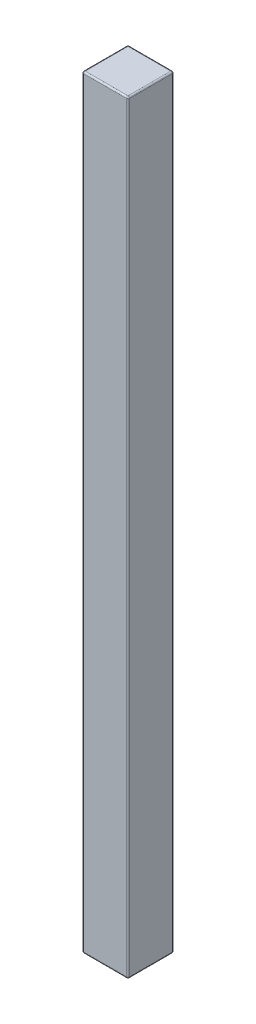
ISO-10303-21;
HEADER;
FILE_DESCRIPTION(('STEP AP214'),'2;1');
FILE_NAME('part.step','',(''),(''),'','','');
FILE_SCHEMA(('AUTOMOTIVE_DESIGN { 1 0 10303 214 1 1 1 1 }'));
ENDSEC;
DATA;
#1=APPLICATION_CONTEXT('core data for automotive mechanical design processes');
#2=APPLICATION_PROTOCOL_DEFINITION('international standard','automotive_design',2000,#1);
#3=PRODUCT_CONTEXT('',#1,'mechanical');
#4=PRODUCT('Part','Part','',(#3));
#5=PRODUCT_RELATED_PRODUCT_CATEGORY('part','',(#4));
#6=PRODUCT_DEFINITION_FORMATION('','',#4);
#7=PRODUCT_DEFINITION_CONTEXT('part definition',#1,'design');
#8=PRODUCT_DEFINITION('design','',#6,#7);
#9=PRODUCT_DEFINITION_SHAPE('','',#8);
#10=(LENGTH_UNIT() NAMED_UNIT(*) SI_UNIT(.MILLI.,.METRE.));
#11=(NAMED_UNIT(*) PLANE_ANGLE_UNIT() SI_UNIT($,.RADIAN.));
#12=(NAMED_UNIT(*) SI_UNIT($,.STERADIAN.) SOLID_ANGLE_UNIT());
#13=UNCERTAINTY_MEASURE_WITH_UNIT(LENGTH_MEASURE(1.E-05),#10,'distance_accuracy_value','');
#14=(GEOMETRIC_REPRESENTATION_CONTEXT(3) GLOBAL_UNCERTAINTY_ASSIGNED_CONTEXT((#13)) GLOBAL_UNIT_ASSIGNED_CONTEXT((#10,
#11,#12)) REPRESENTATION_CONTEXT('',''));
#15=CARTESIAN_POINT('',(0.,0.,0.));
#16=DIRECTION('',(0.,0.,1.));
#17=DIRECTION('',(1.,0.,0.));
#18=AXIS2_PLACEMENT_3D('',#15,#16,#17);
#19=CARTESIAN_POINT('',(1.5,50.,1.5));
#20=DIRECTION('',(-1.,0.,0.));
#21=DIRECTION('',(0.,0.,1.));
#22=AXIS2_PLACEMENT_3D('',#19,#20,#21);
#23=PLANE('',#22);
#24=DIRECTION('',(0.,-1.,0.));
#25=VECTOR('',#24,1.);
#26=CARTESIAN_POINT('',(1.5,50.,-1.4));
#27=LINE('',#26,#25);
#28=CARTESIAN_POINT('',(1.5,0.100000000000003,-1.4));
#29=VERTEX_POINT('',#28);
#30=CARTESIAN_POINT('',(1.5,49.9,-1.4));
#31=VERTEX_POINT('',#30);
#32=EDGE_CURVE('E132',#29,#31,#27,.F.);
#33=ORIENTED_EDGE('',*,*,#32,.T.);
#34=DIRECTION('',(0.,0.,-1.));
#35=VECTOR('',#34,1.);
#36=CARTESIAN_POINT('',(1.5,49.9,1.5));
#37=LINE('',#36,#35);
#38=CARTESIAN_POINT('',(1.5,49.9,1.4));
#39=VERTEX_POINT('',#38);
#40=EDGE_CURVE('E169',#31,#39,#37,.F.);
#41=ORIENTED_EDGE('',*,*,#40,.T.);
#42=DIRECTION('',(0.,-1.,0.));
#43=VECTOR('',#42,1.);
#44=CARTESIAN_POINT('',(1.5,50.,1.4));
#45=LINE('',#44,#43);
#46=CARTESIAN_POINT('',(1.5,0.100000000000003,1.4));
#47=VERTEX_POINT('',#46);
#48=EDGE_CURVE('E166',#39,#47,#45,.T.);
#49=ORIENTED_EDGE('',*,*,#48,.T.);
#50=DIRECTION('',(0.,0.,-1.));
#51=VECTOR('',#50,1.);
#52=CARTESIAN_POINT('',(1.5,0.100000000000003,-1.5));
#53=LINE('',#52,#51);
#54=EDGE_CURVE('E161',#47,#29,#53,.T.);
#55=ORIENTED_EDGE('',*,*,#54,.T.);
#56=EDGE_LOOP('',(#33,#41,#49,#55));
#57=FACE_BOUND('',#56,.T.);
#58=ADVANCED_FACE('F37',(#57),#23,.F.);
#59=CARTESIAN_POINT('',(-1.5,50.,-1.5));
#60=DIRECTION('',(0.,0.,1.));
#61=DIRECTION('',(1.,0.,0.));
#62=AXIS2_PLACEMENT_3D('',#59,#60,#61);
#63=PLANE('',#62);
#64=DIRECTION('',(0.,-1.,0.));
#65=VECTOR('',#64,1.);
#66=CARTESIAN_POINT('',(-1.4,50.,-1.5));
#67=LINE('',#66,#65);
#68=CARTESIAN_POINT('',(-1.4,0.100000000000003,-1.5));
#69=VERTEX_POINT('',#68);
#70=CARTESIAN_POINT('',(-1.4,49.9,-1.5));
#71=VERTEX_POINT('',#70);
#72=EDGE_CURVE('E154',#69,#71,#67,.F.);
#73=ORIENTED_EDGE('',*,*,#72,.T.);
#74=DIRECTION('',(-1.,0.,0.));
#75=VECTOR('',#74,1.);
#76=CARTESIAN_POINT('',(-1.5,49.9,-1.5));
#77=LINE('',#76,#75);
#78=CARTESIAN_POINT('',(1.4,49.9,-1.5));
#79=VERTEX_POINT('',#78);
#80=EDGE_CURVE('E158',#71,#79,#77,.F.);
#81=ORIENTED_EDGE('',*,*,#80,.T.);
#82=DIRECTION('',(0.,-1.,0.));
#83=VECTOR('',#82,1.);
#84=CARTESIAN_POINT('',(1.4,50.,-1.5));
#85=LINE('',#84,#83);
#86=CARTESIAN_POINT('',(1.4,0.100000000000003,-1.5));
#87=VERTEX_POINT('',#86);
#88=EDGE_CURVE('E130',#79,#87,#85,.T.);
#89=ORIENTED_EDGE('',*,*,#88,.T.);
#90=DIRECTION('',(-1.,0.,0.));
#91=VECTOR('',#90,1.);
#92=CARTESIAN_POINT('',(-1.5,0.100000000000003,-1.5));
#93=LINE('',#92,#91);
#94=EDGE_CURVE('E148',#87,#69,#93,.T.);
#95=ORIENTED_EDGE('',*,*,#94,.T.);
#96=EDGE_LOOP('',(#73,#81,#89,#95));
#97=FACE_BOUND('',#96,.T.);
#98=ADVANCED_FACE('F156',(#97),#63,.F.);
#99=CARTESIAN_POINT('',(-1.5,50.,1.5));
#100=DIRECTION('',(1.,0.,0.));
#101=DIRECTION('',(0.,0.,-1.));
#102=AXIS2_PLACEMENT_3D('',#99,#100,#101);
#103=PLANE('',#102);
#104=DIRECTION('',(0.,-1.,0.));
#105=VECTOR('',#104,1.);
#106=CARTESIAN_POINT('',(-1.5,50.,1.4));
#107=LINE('',#106,#105);
#108=CARTESIAN_POINT('',(-1.5,0.100000000000003,1.4));
#109=VERTEX_POINT('',#108);
#110=CARTESIAN_POINT('',(-1.5,49.9,1.4));
#111=VERTEX_POINT('',#110);
#112=EDGE_CURVE('E173',#109,#111,#107,.F.);
#113=ORIENTED_EDGE('',*,*,#112,.T.);
#114=DIRECTION('',(0.,0.,1.));
#115=VECTOR('',#114,1.);
#116=CARTESIAN_POINT('',(-1.5,49.9,1.5));
#117=LINE('',#116,#115);
#118=CARTESIAN_POINT('',(-1.5,49.9,-1.4));
#119=VERTEX_POINT('',#118);
#120=EDGE_CURVE('E178',#111,#119,#117,.F.);
#121=ORIENTED_EDGE('',*,*,#120,.T.);
#122=DIRECTION('',(0.,-1.,0.));
#123=VECTOR('',#122,1.);
#124=CARTESIAN_POINT('',(-1.5,50.,-1.4));
#125=LINE('',#124,#123);
#126=CARTESIAN_POINT('',(-1.5,0.100000000000003,-1.4));
#127=VERTEX_POINT('',#126);
#128=EDGE_CURVE('E175',#119,#127,#125,.T.);
#129=ORIENTED_EDGE('',*,*,#128,.T.);
#130=DIRECTION('',(0.,0.,1.));
#131=VECTOR('',#130,1.);
#132=CARTESIAN_POINT('',(-1.5,0.100000000000003,1.5));
#133=LINE('',#132,#131);
#134=EDGE_CURVE('E171',#127,#109,#133,.T.);
#135=ORIENTED_EDGE('',*,*,#134,.T.);
#136=EDGE_LOOP('',(#113,#121,#129,#135));
#137=FACE_BOUND('',#136,.T.);
#138=ADVANCED_FACE('F283',(#137),#103,.F.);
#139=CARTESIAN_POINT('',(-1.5,50.,1.5));
#140=DIRECTION('',(0.,0.,-1.));
#141=DIRECTION('',(-1.,0.,0.));
#142=AXIS2_PLACEMENT_3D('',#139,#140,#141);
#143=PLANE('',#142);
#144=DIRECTION('',(0.,-1.,0.));
#145=VECTOR('',#144,1.);
#146=CARTESIAN_POINT('',(1.4,50.,1.5));
#147=LINE('',#146,#145);
#148=CARTESIAN_POINT('',(1.4,0.100000000000003,1.5));
#149=VERTEX_POINT('',#148);
#150=CARTESIAN_POINT('',(1.4,49.9,1.5));
#151=VERTEX_POINT('',#150);
#152=EDGE_CURVE('E182',#149,#151,#147,.F.);
#153=ORIENTED_EDGE('',*,*,#152,.T.);
#154=DIRECTION('',(1.,0.,0.));
#155=VECTOR('',#154,1.);
#156=CARTESIAN_POINT('',(-1.5,49.9,1.5));
#157=LINE('',#156,#155);
#158=CARTESIAN_POINT('',(-1.4,49.9,1.5));
#159=VERTEX_POINT('',#158);
#160=EDGE_CURVE('E187',#151,#159,#157,.F.);
#161=ORIENTED_EDGE('',*,*,#160,.T.);
#162=DIRECTION('',(0.,-1.,0.));
#163=VECTOR('',#162,1.);
#164=CARTESIAN_POINT('',(-1.4,50.,1.5));
#165=LINE('',#164,#163);
#166=CARTESIAN_POINT('',(-1.4,0.100000000000003,1.5));
#167=VERTEX_POINT('',#166);
#168=EDGE_CURVE('E184',#159,#167,#165,.T.);
#169=ORIENTED_EDGE('',*,*,#168,.T.);
#170=DIRECTION('',(1.,0.,0.));
#171=VECTOR('',#170,1.);
#172=CARTESIAN_POINT('',(1.5,0.100000000000003,1.5));
#173=LINE('',#172,#171);
#174=EDGE_CURVE('E180',#167,#149,#173,.T.);
#175=ORIENTED_EDGE('',*,*,#174,.T.);
#176=EDGE_LOOP('',(#153,#161,#169,#175));
#177=FACE_BOUND('',#176,.T.);
#178=ADVANCED_FACE('F293',(#177),#143,.F.);
#179=CARTESIAN_POINT('',(0.,50.,0.));
#180=DIRECTION('',(0.,-1.,0.));
#181=DIRECTION('',(0.,0.,-1.));
#182=AXIS2_PLACEMENT_3D('',#179,#180,#181);
#183=PLANE('',#182);
#184=DIRECTION('',(0.,0.,1.));
#185=VECTOR('',#184,1.);
#186=CARTESIAN_POINT('',(-1.4,50.,0.));
#187=LINE('',#186,#185);
#188=CARTESIAN_POINT('',(-1.4,50.,-1.4));
#189=VERTEX_POINT('',#188);
#190=CARTESIAN_POINT('',(-1.4,50.,1.4));
#191=VERTEX_POINT('',#190);
#192=EDGE_CURVE('E193',#189,#191,#187,.T.);
#193=ORIENTED_EDGE('',*,*,#192,.T.);
#194=DIRECTION('',(1.,0.,0.));
#195=VECTOR('',#194,1.);
#196=CARTESIAN_POINT('',(0.,50.,1.4));
#197=LINE('',#196,#195);
#198=CARTESIAN_POINT('',(1.4,50.,1.4));
#199=VERTEX_POINT('',#198);
#200=EDGE_CURVE('E195',#191,#199,#197,.T.);
#201=ORIENTED_EDGE('',*,*,#200,.T.);
#202=DIRECTION('',(0.,0.,-1.));
#203=VECTOR('',#202,1.);
#204=CARTESIAN_POINT('',(1.4,50.,0.));
#205=LINE('',#204,#203);
#206=CARTESIAN_POINT('',(1.4,50.,-1.4));
#207=VERTEX_POINT('',#206);
#208=EDGE_CURVE('E189',#199,#207,#205,.T.);
#209=ORIENTED_EDGE('',*,*,#208,.T.);
#210=DIRECTION('',(-1.,0.,0.));
#211=VECTOR('',#210,1.);
#212=CARTESIAN_POINT('',(0.,50.,-1.4));
#213=LINE('',#212,#211);
#214=EDGE_CURVE('E191',#207,#189,#213,.T.);
#215=ORIENTED_EDGE('',*,*,#214,.T.);
#216=EDGE_LOOP('',(#193,#201,#209,#215));
#217=FACE_BOUND('',#216,.T.);
#218=ADVANCED_FACE('F275',(#217),#183,.F.);
#219=CARTESIAN_POINT('',(0.,0.,0.));
#220=DIRECTION('',(0.,-1.,0.));
#221=DIRECTION('',(0.,0.,-1.));
#222=AXIS2_PLACEMENT_3D('',#219,#220,#221);
#223=PLANE('',#222);
#224=DIRECTION('',(0.,0.,-1.));
#225=VECTOR('',#224,1.);
#226=CARTESIAN_POINT('',(1.4,0.,1.5));
#227=LINE('',#226,#225);
#228=CARTESIAN_POINT('',(1.4,0.,-1.4));
#229=VERTEX_POINT('',#228);
#230=CARTESIAN_POINT('',(1.4,0.,1.4));
#231=VERTEX_POINT('',#230);
#232=EDGE_CURVE('E198',#229,#231,#227,.F.);
#233=ORIENTED_EDGE('',*,*,#232,.T.);
#234=DIRECTION('',(1.,0.,0.));
#235=VECTOR('',#234,1.);
#236=CARTESIAN_POINT('',(-1.5,0.,1.4));
#237=LINE('',#236,#235);
#238=CARTESIAN_POINT('',(-1.4,0.,1.4));
#239=VERTEX_POINT('',#238);
#240=EDGE_CURVE('E11',#231,#239,#237,.F.);
#241=ORIENTED_EDGE('',*,*,#240,.T.);
#242=DIRECTION('',(0.,0.,1.));
#243=VECTOR('',#242,1.);
#244=CARTESIAN_POINT('',(-1.4,0.,-1.5));
#245=LINE('',#244,#243);
#246=CARTESIAN_POINT('',(-1.4,0.,-1.4));
#247=VERTEX_POINT('',#246);
#248=EDGE_CURVE('E46',#239,#247,#245,.F.);
#249=ORIENTED_EDGE('',*,*,#248,.T.);
#250=DIRECTION('',(-1.,0.,0.));
#251=VECTOR('',#250,1.);
#252=CARTESIAN_POINT('',(1.5,0.,-1.4));
#253=LINE('',#252,#251);
#254=EDGE_CURVE('E200',#247,#229,#253,.F.);
#255=ORIENTED_EDGE('',*,*,#254,.T.);
#256=EDGE_LOOP('',(#233,#241,#249,#255));
#257=FACE_BOUND('',#256,.T.);
#258=ADVANCED_FACE('F521',(#257),#223,.T.);
#259=CARTESIAN_POINT('',(-1.4,50.,1.4));
#260=DIRECTION('',(0.,-1.,0.));
#261=DIRECTION('',(0.,0.,-1.));
#262=AXIS2_PLACEMENT_3D('',#259,#260,#261);
#263=CYLINDRICAL_SURFACE('',#262,0.1);
#264=CARTESIAN_POINT('',(-1.4,49.9,1.4));
#265=DIRECTION('',(0.,1.,0.));
#266=DIRECTION('',(0.,0.,1.));
#267=AXIS2_PLACEMENT_3D('',#264,#265,#266);
#268=CIRCLE('',#267,0.1);
#269=EDGE_CURVE('E41',#111,#159,#268,.T.);
#270=ORIENTED_EDGE('',*,*,#269,.F.);
#271=ORIENTED_EDGE('',*,*,#112,.F.);
#272=CARTESIAN_POINT('',(-1.4,0.100000000000003,1.4));
#273=DIRECTION('',(0.,-1.,0.));
#274=DIRECTION('',(0.,0.,-1.));
#275=AXIS2_PLACEMENT_3D('',#272,#273,#274);
#276=CIRCLE('',#275,0.1);
#277=EDGE_CURVE('E253',#167,#109,#276,.T.);
#278=ORIENTED_EDGE('',*,*,#277,.F.);
#279=ORIENTED_EDGE('',*,*,#168,.F.);
#280=EDGE_LOOP('',(#270,#271,#278,#279));
#281=FACE_BOUND('',#280,.T.);
#282=ADVANCED_FACE('F39',(#281),#263,.T.);
#283=CARTESIAN_POINT('',(-1.4,49.9,1.4));
#284=DIRECTION('',(0.,0.,1.));
#285=DIRECTION('',(1.,0.,0.));
#286=AXIS2_PLACEMENT_3D('',#283,#284,#285);
#287=SPHERICAL_SURFACE('',#286,0.1);
#288=CARTESIAN_POINT('',(-1.4,49.9,1.4));
#289=DIRECTION('',(0.,0.,1.));
#290=DIRECTION('',(1.,0.,0.));
#291=AXIS2_PLACEMENT_3D('',#288,#289,#290);
#292=CIRCLE('',#291,0.1);
#293=EDGE_CURVE('E248',#111,#191,#292,.F.);
#294=ORIENTED_EDGE('',*,*,#293,.F.);
#295=ORIENTED_EDGE('',*,*,#269,.T.);
#296=CARTESIAN_POINT('',(-1.4,49.9,1.4));
#297=DIRECTION('',(-1.,0.,0.));
#298=DIRECTION('',(0.,0.,1.));
#299=AXIS2_PLACEMENT_3D('',#296,#297,#298);
#300=CIRCLE('',#299,0.1);
#301=EDGE_CURVE('E251',#191,#159,#300,.F.);
#302=ORIENTED_EDGE('',*,*,#301,.F.);
#303=EDGE_LOOP('',(#294,#295,#302));
#304=FACE_BOUND('',#303,.T.);
#305=ADVANCED_FACE('F263',(#304),#287,.T.);
#306=CARTESIAN_POINT('',(-1.4,0.1,1.4));
#307=DIRECTION('',(-1.,0.,0.));
#308=DIRECTION('',(0.,-1.,0.));
#309=AXIS2_PLACEMENT_3D('',#306,#307,#308);
#310=SPHERICAL_SURFACE('',#309,0.1);
#311=CARTESIAN_POINT('',(-1.4,0.1,1.4));
#312=DIRECTION('',(-1.,0.,0.));
#313=DIRECTION('',(0.,0.,1.));
#314=AXIS2_PLACEMENT_3D('',#311,#312,#313);
#315=CIRCLE('',#314,0.1);
#316=EDGE_CURVE('E243',#167,#239,#315,.F.);
#317=ORIENTED_EDGE('',*,*,#316,.F.);
#318=ORIENTED_EDGE('',*,*,#277,.T.);
#319=CARTESIAN_POINT('',(-1.4,0.100000000000003,1.4));
#320=DIRECTION('',(0.,0.,1.));
#321=DIRECTION('',(1.,0.,0.));
#322=AXIS2_PLACEMENT_3D('',#319,#320,#321);
#323=CIRCLE('',#322,0.1);
#324=EDGE_CURVE('E246',#239,#109,#323,.F.);
#325=ORIENTED_EDGE('',*,*,#324,.F.);
#326=EDGE_LOOP('',(#317,#318,#325));
#327=FACE_BOUND('',#326,.T.);
#328=ADVANCED_FACE('F494',(#327),#310,.T.);
#329=CARTESIAN_POINT('',(0.,49.9,1.4));
#330=DIRECTION('',(1.,0.,0.));
#331=DIRECTION('',(0.,0.,-1.));
#332=AXIS2_PLACEMENT_3D('',#329,#330,#331);
#333=CYLINDRICAL_SURFACE('',#332,0.1);
#334=ORIENTED_EDGE('',*,*,#301,.T.);
#335=ORIENTED_EDGE('',*,*,#160,.F.);
#336=CARTESIAN_POINT('',(1.4,49.9,1.4));
#337=DIRECTION('',(1.,0.,0.));
#338=DIRECTION('',(0.,0.,-1.));
#339=AXIS2_PLACEMENT_3D('',#336,#337,#338);
#340=CIRCLE('',#339,0.1);
#341=EDGE_CURVE('E237',#199,#151,#340,.T.);
#342=ORIENTED_EDGE('',*,*,#341,.F.);
#343=ORIENTED_EDGE('',*,*,#200,.F.);
#344=EDGE_LOOP('',(#334,#335,#342,#343));
#345=FACE_BOUND('',#344,.T.);
#346=ADVANCED_FACE('F271',(#345),#333,.T.);
#347=CARTESIAN_POINT('',(-1.4,49.9,0.));
#348=DIRECTION('',(0.,0.,1.));
#349=DIRECTION('',(1.,0.,0.));
#350=AXIS2_PLACEMENT_3D('',#347,#348,#349);
#351=CYLINDRICAL_SURFACE('',#350,0.1);
#352=ORIENTED_EDGE('',*,*,#293,.T.);
#353=ORIENTED_EDGE('',*,*,#192,.F.);
#354=CARTESIAN_POINT('',(-1.4,49.9,-1.4));
#355=DIRECTION('',(0.,0.,-1.));
#356=DIRECTION('',(0.,1.,0.));
#357=AXIS2_PLACEMENT_3D('',#354,#355,#356);
#358=CIRCLE('',#357,0.1);
#359=EDGE_CURVE('E234',#119,#189,#358,.T.);
#360=ORIENTED_EDGE('',*,*,#359,.F.);
#361=ORIENTED_EDGE('',*,*,#120,.F.);
#362=EDGE_LOOP('',(#352,#353,#360,#361));
#363=FACE_BOUND('',#362,.T.);
#364=ADVANCED_FACE('F280',(#363),#351,.T.);
#365=CARTESIAN_POINT('',(-1.4,50.,-1.4));
#366=DIRECTION('',(0.,-1.,0.));
#367=DIRECTION('',(0.,0.,-1.));
#368=AXIS2_PLACEMENT_3D('',#365,#366,#367);
#369=CYLINDRICAL_SURFACE('',#368,0.1);
#370=CARTESIAN_POINT('',(-1.4,0.100000000000003,-1.4));
#371=DIRECTION('',(0.,-1.,0.));
#372=DIRECTION('',(0.,0.,-1.));
#373=AXIS2_PLACEMENT_3D('',#370,#371,#372);
#374=CIRCLE('',#373,0.1);
#375=EDGE_CURVE('E228',#127,#69,#374,.T.);
#376=ORIENTED_EDGE('',*,*,#375,.F.);
#377=ORIENTED_EDGE('',*,*,#128,.F.);
#378=CARTESIAN_POINT('',(-1.4,49.9,-1.4));
#379=DIRECTION('',(0.,1.,0.));
#380=DIRECTION('',(0.,0.,1.));
#381=AXIS2_PLACEMENT_3D('',#378,#379,#380);
#382=CIRCLE('',#381,0.1);
#383=EDGE_CURVE('E231',#71,#119,#382,.T.);
#384=ORIENTED_EDGE('',*,*,#383,.F.);
#385=ORIENTED_EDGE('',*,*,#72,.F.);
#386=EDGE_LOOP('',(#376,#377,#384,#385));
#387=FACE_BOUND('',#386,.T.);
#388=ADVANCED_FACE('F287',(#387),#369,.T.);
#389=CARTESIAN_POINT('',(-1.4,0.100000000000003,1.5));
#390=DIRECTION('',(0.,0.,-1.));
#391=DIRECTION('',(-1.,0.,0.));
#392=AXIS2_PLACEMENT_3D('',#389,#390,#391);
#393=CYLINDRICAL_SURFACE('',#392,0.1);
#394=ORIENTED_EDGE('',*,*,#324,.T.);
#395=ORIENTED_EDGE('',*,*,#134,.F.);
#396=CARTESIAN_POINT('',(-1.4,0.1,-1.4));
#397=DIRECTION('',(0.,0.,-1.));
#398=DIRECTION('',(-1.,0.,0.));
#399=AXIS2_PLACEMENT_3D('',#396,#397,#398);
#400=CIRCLE('',#399,0.1);
#401=EDGE_CURVE('E226',#247,#127,#400,.T.);
#402=ORIENTED_EDGE('',*,*,#401,.F.);
#403=ORIENTED_EDGE('',*,*,#248,.F.);
#404=EDGE_LOOP('',(#394,#395,#402,#403));
#405=FACE_BOUND('',#404,.T.);
#406=ADVANCED_FACE('F291',(#405),#393,.T.);
#407=CARTESIAN_POINT('',(-1.5,0.100000000000003,1.4));
#408=DIRECTION('',(-1.,0.,0.));
#409=DIRECTION('',(0.,0.,1.));
#410=AXIS2_PLACEMENT_3D('',#407,#408,#409);
#411=CYLINDRICAL_SURFACE('',#410,0.1);
#412=ORIENTED_EDGE('',*,*,#316,.T.);
#413=ORIENTED_EDGE('',*,*,#240,.F.);
#414=CARTESIAN_POINT('',(1.4,0.100000000000003,1.4));
#415=DIRECTION('',(1.,0.,0.));
#416=DIRECTION('',(0.,0.,-1.));
#417=AXIS2_PLACEMENT_3D('',#414,#415,#416);
#418=CIRCLE('',#417,0.1);
#419=EDGE_CURVE('E223',#149,#231,#418,.T.);
#420=ORIENTED_EDGE('',*,*,#419,.F.);
#421=ORIENTED_EDGE('',*,*,#174,.F.);
#422=EDGE_LOOP('',(#412,#413,#420,#421));
#423=FACE_BOUND('',#422,.T.);
#424=ADVANCED_FACE('F303',(#423),#411,.T.);
#425=CARTESIAN_POINT('',(1.4,50.,1.4));
#426=DIRECTION('',(0.,-1.,0.));
#427=DIRECTION('',(0.,0.,-1.));
#428=AXIS2_PLACEMENT_3D('',#425,#426,#427);
#429=CYLINDRICAL_SURFACE('',#428,0.1);
#430=CARTESIAN_POINT('',(1.4,49.9,1.4));
#431=DIRECTION('',(0.,1.,0.));
#432=DIRECTION('',(0.,0.,1.));
#433=AXIS2_PLACEMENT_3D('',#430,#431,#432);
#434=CIRCLE('',#433,0.1);
#435=EDGE_CURVE('E240',#151,#39,#434,.T.);
#436=ORIENTED_EDGE('',*,*,#435,.F.);
#437=ORIENTED_EDGE('',*,*,#152,.F.);
#438=CARTESIAN_POINT('',(1.4,0.100000000000003,1.4));
#439=DIRECTION('',(0.,-1.,0.));
#440=DIRECTION('',(0.,0.,-1.));
#441=AXIS2_PLACEMENT_3D('',#438,#439,#440);
#442=CIRCLE('',#441,0.1);
#443=EDGE_CURVE('E220',#47,#149,#442,.T.);
#444=ORIENTED_EDGE('',*,*,#443,.F.);
#445=ORIENTED_EDGE('',*,*,#48,.F.);
#446=EDGE_LOOP('',(#436,#437,#444,#445));
#447=FACE_BOUND('',#446,.T.);
#448=ADVANCED_FACE('F298',(#447),#429,.T.);
#449=CARTESIAN_POINT('',(1.4,49.9,1.4));
#450=DIRECTION('',(0.,0.,1.));
#451=DIRECTION('',(1.,0.,0.));
#452=AXIS2_PLACEMENT_3D('',#449,#450,#451);
#453=SPHERICAL_SURFACE('',#452,0.1);
#454=ORIENTED_EDGE('',*,*,#341,.T.);
#455=ORIENTED_EDGE('',*,*,#435,.T.);
#456=CARTESIAN_POINT('',(1.4,49.9,1.4));
#457=DIRECTION('',(0.,0.,1.));
#458=DIRECTION('',(1.,0.,0.));
#459=AXIS2_PLACEMENT_3D('',#456,#457,#458);
#460=CIRCLE('',#459,0.1);
#461=EDGE_CURVE('E217',#199,#39,#460,.F.);
#462=ORIENTED_EDGE('',*,*,#461,.F.);
#463=EDGE_LOOP('',(#454,#455,#462));
#464=FACE_BOUND('',#463,.T.);
#465=ADVANCED_FACE('F314',(#464),#453,.T.);
#466=CARTESIAN_POINT('',(-1.4,49.9,-1.4));
#467=DIRECTION('',(-1.,0.,0.));
#468=DIRECTION('',(0.,0.,1.));
#469=AXIS2_PLACEMENT_3D('',#466,#467,#468);
#470=SPHERICAL_SURFACE('',#469,0.1);
#471=ORIENTED_EDGE('',*,*,#383,.T.);
#472=ORIENTED_EDGE('',*,*,#359,.T.);
#473=CARTESIAN_POINT('',(-1.4,49.9,-1.4));
#474=DIRECTION('',(-1.,0.,0.));
#475=DIRECTION('',(0.,0.,1.));
#476=AXIS2_PLACEMENT_3D('',#473,#474,#475);
#477=CIRCLE('',#476,0.1);
#478=EDGE_CURVE('E214',#71,#189,#477,.F.);
#479=ORIENTED_EDGE('',*,*,#478,.F.);
#480=EDGE_LOOP('',(#471,#472,#479));
#481=FACE_BOUND('',#480,.T.);
#482=ADVANCED_FACE('F324',(#481),#470,.T.);
#483=CARTESIAN_POINT('',(-1.4,0.1,-1.4));
#484=DIRECTION('',(-1.,0.,0.));
#485=DIRECTION('',(0.,-1.,0.));
#486=AXIS2_PLACEMENT_3D('',#483,#484,#485);
#487=SPHERICAL_SURFACE('',#486,0.1);
#488=ORIENTED_EDGE('',*,*,#401,.T.);
#489=ORIENTED_EDGE('',*,*,#375,.T.);
#490=CARTESIAN_POINT('',(-1.4,0.100000000000003,-1.4));
#491=DIRECTION('',(-1.,0.,0.));
#492=DIRECTION('',(0.,0.,1.));
#493=AXIS2_PLACEMENT_3D('',#490,#491,#492);
#494=CIRCLE('',#493,0.1);
#495=EDGE_CURVE('E151',#247,#69,#494,.F.);
#496=ORIENTED_EDGE('',*,*,#495,.F.);
#497=EDGE_LOOP('',(#488,#489,#496));
#498=FACE_BOUND('',#497,.T.);
#499=ADVANCED_FACE('F326',(#498),#487,.T.);
#500=CARTESIAN_POINT('',(1.4,0.1,1.4));
#501=DIRECTION('',(0.,0.,1.));
#502=DIRECTION('',(0.,-1.,0.));
#503=AXIS2_PLACEMENT_3D('',#500,#501,#502);
#504=SPHERICAL_SURFACE('',#503,0.1);
#505=ORIENTED_EDGE('',*,*,#443,.T.);
#506=ORIENTED_EDGE('',*,*,#419,.T.);
#507=CARTESIAN_POINT('',(1.4,0.1,1.4));
#508=DIRECTION('',(0.,0.,1.));
#509=DIRECTION('',(1.,0.,0.));
#510=AXIS2_PLACEMENT_3D('',#507,#508,#509);
#511=CIRCLE('',#510,0.1);
#512=EDGE_CURVE('E210',#47,#231,#511,.F.);
#513=ORIENTED_EDGE('',*,*,#512,.F.);
#514=EDGE_LOOP('',(#505,#506,#513));
#515=FACE_BOUND('',#514,.T.);
#516=ADVANCED_FACE('F305',(#515),#504,.T.);
#517=CARTESIAN_POINT('',(1.4,49.9,0.));
#518=DIRECTION('',(0.,0.,-1.));
#519=DIRECTION('',(-1.,0.,0.));
#520=AXIS2_PLACEMENT_3D('',#517,#518,#519);
#521=CYLINDRICAL_SURFACE('',#520,0.1);
#522=ORIENTED_EDGE('',*,*,#461,.T.);
#523=ORIENTED_EDGE('',*,*,#40,.F.);
#524=CARTESIAN_POINT('',(1.4,49.9,-1.4));
#525=DIRECTION('',(0.,0.,-1.));
#526=DIRECTION('',(-1.,0.,0.));
#527=AXIS2_PLACEMENT_3D('',#524,#525,#526);
#528=CIRCLE('',#527,0.1);
#529=EDGE_CURVE('E207',#207,#31,#528,.T.);
#530=ORIENTED_EDGE('',*,*,#529,.F.);
#531=ORIENTED_EDGE('',*,*,#208,.F.);
#532=EDGE_LOOP('',(#522,#523,#530,#531));
#533=FACE_BOUND('',#532,.T.);
#534=ADVANCED_FACE('F316',(#533),#521,.T.);
#535=CARTESIAN_POINT('',(0.,49.9,-1.4));
#536=DIRECTION('',(-1.,0.,0.));
#537=DIRECTION('',(0.,0.,1.));
#538=AXIS2_PLACEMENT_3D('',#535,#536,#537);
#539=CYLINDRICAL_SURFACE('',#538,0.1);
#540=ORIENTED_EDGE('',*,*,#478,.T.);
#541=ORIENTED_EDGE('',*,*,#214,.F.);
#542=CARTESIAN_POINT('',(1.4,49.9,-1.4));
#543=DIRECTION('',(1.,0.,0.));
#544=DIRECTION('',(0.,0.,-1.));
#545=AXIS2_PLACEMENT_3D('',#542,#543,#544);
#546=CIRCLE('',#545,0.1);
#547=EDGE_CURVE('E145',#79,#207,#546,.T.);
#548=ORIENTED_EDGE('',*,*,#547,.F.);
#549=ORIENTED_EDGE('',*,*,#80,.F.);
#550=EDGE_LOOP('',(#540,#541,#548,#549));
#551=FACE_BOUND('',#550,.T.);
#552=ADVANCED_FACE('F322',(#551),#539,.T.);
#553=CARTESIAN_POINT('',(-1.5,0.100000000000003,-1.4));
#554=DIRECTION('',(1.,0.,0.));
#555=DIRECTION('',(0.,0.,-1.));
#556=AXIS2_PLACEMENT_3D('',#553,#554,#555);
#557=CYLINDRICAL_SURFACE('',#556,0.1);
#558=ORIENTED_EDGE('',*,*,#495,.T.);
#559=ORIENTED_EDGE('',*,*,#94,.F.);
#560=CARTESIAN_POINT('',(1.4,0.1,-1.4));
#561=DIRECTION('',(1.,0.,0.));
#562=DIRECTION('',(0.,0.,-1.));
#563=AXIS2_PLACEMENT_3D('',#560,#561,#562);
#564=CIRCLE('',#563,0.1);
#565=EDGE_CURVE('E138',#229,#87,#564,.T.);
#566=ORIENTED_EDGE('',*,*,#565,.F.);
#567=ORIENTED_EDGE('',*,*,#254,.F.);
#568=EDGE_LOOP('',(#558,#559,#566,#567));
#569=FACE_BOUND('',#568,.T.);
#570=ADVANCED_FACE('F149',(#569),#557,.T.);
#571=CARTESIAN_POINT('',(1.4,0.100000000000003,1.5));
#572=DIRECTION('',(0.,0.,1.));
#573=DIRECTION('',(1.,0.,0.));
#574=AXIS2_PLACEMENT_3D('',#571,#572,#573);
#575=CYLINDRICAL_SURFACE('',#574,0.1);
#576=ORIENTED_EDGE('',*,*,#512,.T.);
#577=ORIENTED_EDGE('',*,*,#232,.F.);
#578=CARTESIAN_POINT('',(1.4,0.100000000000003,-1.4));
#579=DIRECTION('',(0.,0.,-1.));
#580=DIRECTION('',(-1.,0.,0.));
#581=AXIS2_PLACEMENT_3D('',#578,#579,#580);
#582=CIRCLE('',#581,0.1);
#583=EDGE_CURVE('E142',#29,#229,#582,.T.);
#584=ORIENTED_EDGE('',*,*,#583,.F.);
#585=ORIENTED_EDGE('',*,*,#54,.F.);
#586=EDGE_LOOP('',(#576,#577,#584,#585));
#587=FACE_BOUND('',#586,.T.);
#588=ADVANCED_FACE('F309',(#587),#575,.T.);
#589=CARTESIAN_POINT('',(1.4,49.9,-1.4));
#590=DIRECTION('',(0.,1.,0.));
#591=DIRECTION('',(0.,0.,1.));
#592=AXIS2_PLACEMENT_3D('',#589,#590,#591);
#593=SPHERICAL_SURFACE('',#592,0.1);
#594=ORIENTED_EDGE('',*,*,#547,.T.);
#595=ORIENTED_EDGE('',*,*,#529,.T.);
#596=CARTESIAN_POINT('',(1.4,49.9,-1.4));
#597=DIRECTION('',(0.,1.,0.));
#598=DIRECTION('',(0.,0.,1.));
#599=AXIS2_PLACEMENT_3D('',#596,#597,#598);
#600=CIRCLE('',#599,0.1);
#601=EDGE_CURVE('E135',#79,#31,#600,.F.);
#602=ORIENTED_EDGE('',*,*,#601,.F.);
#603=EDGE_LOOP('',(#594,#595,#602));
#604=FACE_BOUND('',#603,.T.);
#605=ADVANCED_FACE('F320',(#604),#593,.T.);
#606=CARTESIAN_POINT('',(1.4,0.1,-1.4));
#607=DIRECTION('',(0.,-1.,0.));
#608=DIRECTION('',(0.,0.,-1.));
#609=AXIS2_PLACEMENT_3D('',#606,#607,#608);
#610=SPHERICAL_SURFACE('',#609,0.1);
#611=ORIENTED_EDGE('',*,*,#583,.T.);
#612=ORIENTED_EDGE('',*,*,#565,.T.);
#613=CARTESIAN_POINT('',(1.4,0.100000000000003,-1.4));
#614=DIRECTION('',(0.,-1.,0.));
#615=DIRECTION('',(0.,0.,-1.));
#616=AXIS2_PLACEMENT_3D('',#613,#614,#615);
#617=CIRCLE('',#616,0.1);
#618=EDGE_CURVE('E126',#29,#87,#617,.F.);
#619=ORIENTED_EDGE('',*,*,#618,.F.);
#620=EDGE_LOOP('',(#611,#612,#619));
#621=FACE_BOUND('',#620,.T.);
#622=ADVANCED_FACE('F140',(#621),#610,.T.);
#623=CARTESIAN_POINT('',(1.4,50.,-1.4));
#624=DIRECTION('',(0.,-1.,0.));
#625=DIRECTION('',(0.,0.,-1.));
#626=AXIS2_PLACEMENT_3D('',#623,#624,#625);
#627=CYLINDRICAL_SURFACE('',#626,0.1);
#628=ORIENTED_EDGE('',*,*,#601,.T.);
#629=ORIENTED_EDGE('',*,*,#32,.F.);
#630=ORIENTED_EDGE('',*,*,#618,.T.);
#631=ORIENTED_EDGE('',*,*,#88,.F.);
#632=EDGE_LOOP('',(#628,#629,#630,#631));
#633=FACE_BOUND('',#632,.T.);
#634=ADVANCED_FACE('F128',(#633),#627,.T.);
#635=CLOSED_SHELL('',(#58,#98,#138,#178,#218,#258,#282,#305,#328,#346,#364,#388,#406,#424,#448,
#465,#482,#499,#516,#534,#552,#570,#588,#605,#622,#634));
#636=MANIFOLD_SOLID_BREP('B2',#635);
#637=ADVANCED_BREP_SHAPE_REPRESENTATION('',(#18,#636),#14);
#638=SHAPE_DEFINITION_REPRESENTATION(#9,#637);
ENDSEC;
END-ISO-10303-21;
